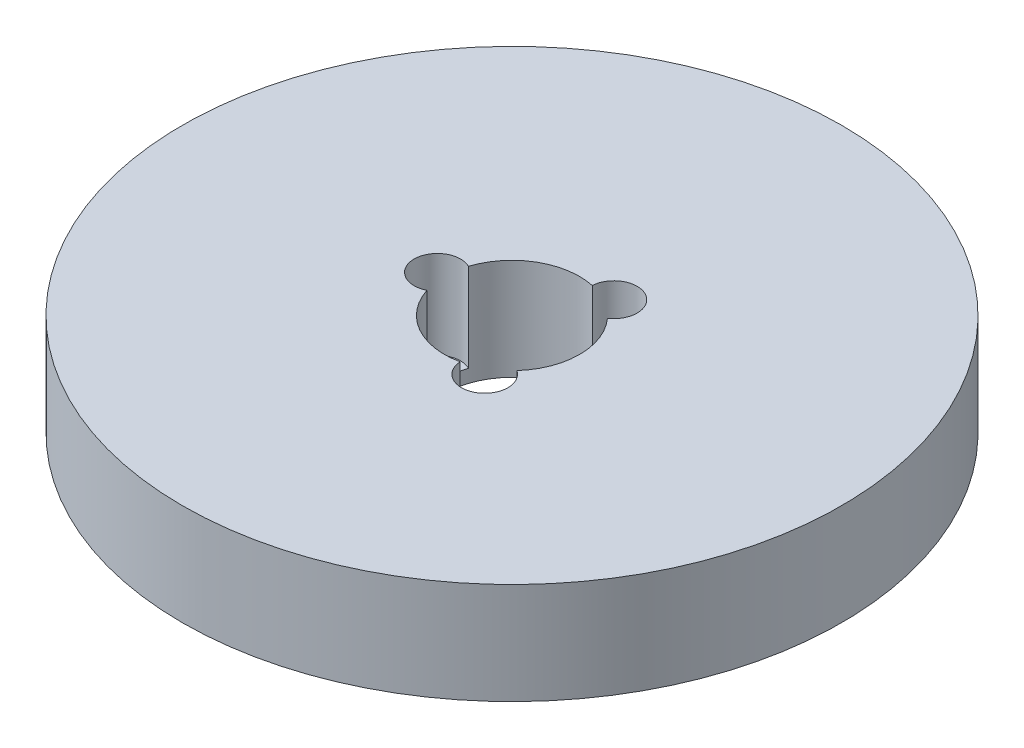
ISO-10303-21;
HEADER;
FILE_DESCRIPTION(('STEP AP214'),'2;1');
FILE_NAME('part.step','',(''),(''),'','','');
FILE_SCHEMA(('AUTOMOTIVE_DESIGN { 1 0 10303 214 1 1 1 1 }'));
ENDSEC;
DATA;
#1=APPLICATION_CONTEXT('core data for automotive mechanical design processes');
#2=APPLICATION_PROTOCOL_DEFINITION('international standard','automotive_design',2000,#1);
#3=PRODUCT_CONTEXT('',#1,'mechanical');
#4=PRODUCT('Part','Part','',(#3));
#5=PRODUCT_RELATED_PRODUCT_CATEGORY('part','',(#4));
#6=PRODUCT_DEFINITION_FORMATION('','',#4);
#7=PRODUCT_DEFINITION_CONTEXT('part definition',#1,'design');
#8=PRODUCT_DEFINITION('design','',#6,#7);
#9=PRODUCT_DEFINITION_SHAPE('','',#8);
#10=(LENGTH_UNIT() NAMED_UNIT(*) SI_UNIT(.MILLI.,.METRE.));
#11=(NAMED_UNIT(*) PLANE_ANGLE_UNIT() SI_UNIT($,.RADIAN.));
#12=(NAMED_UNIT(*) SI_UNIT($,.STERADIAN.) SOLID_ANGLE_UNIT());
#13=UNCERTAINTY_MEASURE_WITH_UNIT(LENGTH_MEASURE(1.E-05),#10,'distance_accuracy_value','');
#14=(GEOMETRIC_REPRESENTATION_CONTEXT(3) GLOBAL_UNCERTAINTY_ASSIGNED_CONTEXT((#13)) GLOBAL_UNIT_ASSIGNED_CONTEXT((#10,
#11,#12)) REPRESENTATION_CONTEXT('',''));
#15=CARTESIAN_POINT('',(0.,0.,0.));
#16=DIRECTION('',(0.,0.,1.));
#17=DIRECTION('',(1.,0.,0.));
#18=AXIS2_PLACEMENT_3D('',#15,#16,#17);
#19=CARTESIAN_POINT('',(0.,30.,0.));
#20=DIRECTION('',(0.,-1.,0.));
#21=DIRECTION('',(0.,0.,-1.));
#22=AXIS2_PLACEMENT_3D('',#19,#20,#21);
#23=CYLINDRICAL_SURFACE('',#22,97.5);
#24=CARTESIAN_POINT('',(0.,30.,0.));
#25=DIRECTION('',(0.,1.,0.));
#26=DIRECTION('',(0.,0.,1.));
#27=AXIS2_PLACEMENT_3D('',#24,#25,#26);
#28=CIRCLE('',#27,97.5);
#29=CARTESIAN_POINT('',(0.,30.,97.5));
#30=VERTEX_POINT('',#29);
#31=EDGE_CURVE('E126',#30,#30,#28,.T.);
#32=ORIENTED_EDGE('',*,*,#31,.F.);
#33=EDGE_LOOP('',(#32));
#34=FACE_BOUND('',#33,.T.);
#35=CARTESIAN_POINT('',(0.,0.,0.));
#36=DIRECTION('',(0.,1.,0.));
#37=DIRECTION('',(0.,0.,1.));
#38=AXIS2_PLACEMENT_3D('',#35,#36,#37);
#39=CIRCLE('',#38,97.5);
#40=CARTESIAN_POINT('',(0.,0.,97.5));
#41=VERTEX_POINT('',#40);
#42=EDGE_CURVE('E124',#41,#41,#39,.T.);
#43=ORIENTED_EDGE('',*,*,#42,.T.);
#44=EDGE_LOOP('',(#43));
#45=FACE_BOUND('',#44,.T.);
#46=ADVANCED_FACE('F39',(#34,#45),#23,.T.);
#47=CARTESIAN_POINT('',(0.,30.,0.));
#48=DIRECTION('',(0.,1.,0.));
#49=DIRECTION('',(0.,0.,1.));
#50=AXIS2_PLACEMENT_3D('',#47,#48,#49);
#51=PLANE('',#50);
#52=CARTESIAN_POINT('',(11.0405874034857,30.,19.122858328242));
#53=DIRECTION('',(0.,1.,0.));
#54=DIRECTION('',(0.866025403784436,0.,-0.500000000000004));
#55=AXIS2_PLACEMENT_3D('',#52,#53,#54);
#56=CIRCLE('',#55,6.86794331125664);
#57=CARTESIAN_POINT('',(4.18637624386,30.,19.556948993768));
#58=VERTEX_POINT('',#57);
#59=CARTESIAN_POINT('',(14.8436265271898,30.,13.4039826738663));
#60=VERTEX_POINT('',#59);
#61=EDGE_CURVE('E147',#58,#60,#56,.T.);
#62=ORIENTED_EDGE('',*,*,#61,.F.);
#63=CARTESIAN_POINT('',(0.,30.,0.));
#64=DIRECTION('',(0.,1.,0.));
#65=DIRECTION('',(0.,0.,1.));
#66=AXIS2_PLACEMENT_3D('',#63,#64,#65);
#67=CIRCLE('',#66,20.);
#68=CARTESIAN_POINT('',(-19.0300027710496,30.,6.15296631990167));
#69=VERTEX_POINT('',#68);
#70=EDGE_CURVE('E118',#69,#58,#67,.T.);
#71=ORIENTED_EDGE('',*,*,#70,.F.);
#72=CARTESIAN_POINT('',(-22.0811748069713,30.,0.));
#73=DIRECTION('',(0.,1.,0.));
#74=DIRECTION('',(0.,0.,1.));
#75=AXIS2_PLACEMENT_3D('',#72,#73,#74);
#76=CIRCLE('',#75,6.86794331125664);
#77=CARTESIAN_POINT('',(-19.0300027710496,30.,-6.15296631990167));
#78=VERTEX_POINT('',#77);
#79=EDGE_CURVE('E113',#78,#69,#76,.T.);
#80=ORIENTED_EDGE('',*,*,#79,.F.);
#81=CARTESIAN_POINT('',(4.18637624385972,30.,-19.5569489937681));
#82=VERTEX_POINT('',#81);
#83=EDGE_CURVE('E106',#82,#78,#67,.T.);
#84=ORIENTED_EDGE('',*,*,#83,.F.);
#85=CARTESIAN_POINT('',(11.0405874034855,30.,-19.1228583282422));
#86=DIRECTION('',(0.,1.,0.));
#87=DIRECTION('',(-0.866025403784443,0.,-0.499999999999992));
#88=AXIS2_PLACEMENT_3D('',#85,#86,#87);
#89=CIRCLE('',#88,6.86794331125664);
#90=CARTESIAN_POINT('',(14.8436265271896,30.,-13.4039826738665));
#91=VERTEX_POINT('',#90);
#92=EDGE_CURVE('E90',#91,#82,#89,.T.);
#93=ORIENTED_EDGE('',*,*,#92,.F.);
#94=EDGE_CURVE('E116',#60,#91,#67,.T.);
#95=ORIENTED_EDGE('',*,*,#94,.F.);
#96=EDGE_LOOP('',(#62,#71,#80,#84,#93,#95));
#97=FACE_BOUND('',#96,.T.);
#98=ORIENTED_EDGE('',*,*,#31,.T.);
#99=EDGE_LOOP('',(#98));
#100=FACE_BOUND('',#99,.T.);
#101=ADVANCED_FACE('F115',(#97,#100),#51,.T.);
#102=CARTESIAN_POINT('',(0.,0.,0.));
#103=DIRECTION('',(0.,1.,0.));
#104=DIRECTION('',(0.,0.,1.));
#105=AXIS2_PLACEMENT_3D('',#102,#103,#104);
#106=PLANE('',#105);
#107=CARTESIAN_POINT('',(0.,0.,0.));
#108=DIRECTION('',(0.,1.,0.));
#109=DIRECTION('',(0.,0.,1.));
#110=AXIS2_PLACEMENT_3D('',#107,#108,#109);
#111=CIRCLE('',#110,20.);
#112=CARTESIAN_POINT('',(0.,0.,20.));
#113=VERTEX_POINT('',#112);
#114=EDGE_CURVE('E120',#113,#113,#111,.T.);
#115=ORIENTED_EDGE('',*,*,#114,.T.);
#116=EDGE_LOOP('',(#115));
#117=FACE_BOUND('',#116,.T.);
#118=ORIENTED_EDGE('',*,*,#42,.F.);
#119=EDGE_LOOP('',(#118));
#120=FACE_BOUND('',#119,.T.);
#121=ADVANCED_FACE('F164',(#117,#120),#106,.F.);
#122=CARTESIAN_POINT('',(0.,30.,0.));
#123=DIRECTION('',(0.,-1.,0.));
#124=DIRECTION('',(0.,0.,-1.));
#125=AXIS2_PLACEMENT_3D('',#122,#123,#124);
#126=CYLINDRICAL_SURFACE('',#125,20.);
#127=DIRECTION('',(0.,1.,0.));
#128=VECTOR('',#127,1.);
#129=CARTESIAN_POINT('',(4.18637624386,16.9452683477106,19.556948993768));
#130=LINE('',#129,#128);
#131=CARTESIAN_POINT('',(4.18637624386,3.89053669542121,19.556948993768));
#132=VERTEX_POINT('',#131);
#133=EDGE_CURVE('E11',#132,#58,#130,.T.);
#134=ORIENTED_EDGE('',*,*,#133,.F.);
#135=CARTESIAN_POINT('',(0.,3.89053669542121,0.));
#136=DIRECTION('',(0.,1.,0.));
#137=DIRECTION('',(0.,0.,1.));
#138=AXIS2_PLACEMENT_3D('',#135,#136,#137);
#139=CIRCLE('',#138,20.);
#140=CARTESIAN_POINT('',(14.8436265271898,3.89053669542121,13.4039826738663));
#141=VERTEX_POINT('',#140);
#142=EDGE_CURVE('E144',#132,#141,#139,.T.);
#143=ORIENTED_EDGE('',*,*,#142,.T.);
#144=DIRECTION('',(0.,1.,0.));
#145=VECTOR('',#144,1.);
#146=CARTESIAN_POINT('',(14.8436265271898,16.9452683477106,13.4039826738663));
#147=LINE('',#146,#145);
#148=EDGE_CURVE('E46',#60,#141,#147,.F.);
#149=ORIENTED_EDGE('',*,*,#148,.F.);
#150=ORIENTED_EDGE('',*,*,#94,.T.);
#151=DIRECTION('',(0.,1.,0.));
#152=VECTOR('',#151,1.);
#153=CARTESIAN_POINT('',(14.8436265271896,16.9452683477106,-13.4039826738665));
#154=LINE('',#153,#152);
#155=CARTESIAN_POINT('',(14.8436265271896,3.89053669542121,-13.4039826738665));
#156=VERTEX_POINT('',#155);
#157=EDGE_CURVE('E92',#156,#91,#154,.T.);
#158=ORIENTED_EDGE('',*,*,#157,.F.);
#159=CARTESIAN_POINT('',(0.,3.89053669542121,0.));
#160=DIRECTION('',(0.,1.,0.));
#161=DIRECTION('',(0.,0.,1.));
#162=AXIS2_PLACEMENT_3D('',#159,#160,#161);
#163=CIRCLE('',#162,20.);
#164=CARTESIAN_POINT('',(4.18637624385972,3.89053669542121,-19.5569489937681));
#165=VERTEX_POINT('',#164);
#166=EDGE_CURVE('E107',#156,#165,#163,.T.);
#167=ORIENTED_EDGE('',*,*,#166,.T.);
#168=DIRECTION('',(0.,1.,0.));
#169=VECTOR('',#168,1.);
#170=CARTESIAN_POINT('',(4.18637624385972,16.9452683477106,-19.5569489937681));
#171=LINE('',#170,#169);
#172=EDGE_CURVE('E95',#82,#165,#171,.F.);
#173=ORIENTED_EDGE('',*,*,#172,.F.);
#174=ORIENTED_EDGE('',*,*,#83,.T.);
#175=DIRECTION('',(0.,1.,0.));
#176=VECTOR('',#175,1.);
#177=CARTESIAN_POINT('',(-19.0300027710496,16.9452683477106,-6.15296631990168));
#178=LINE('',#177,#176);
#179=CARTESIAN_POINT('',(-19.0300027710496,3.89053669542121,-6.15296631990167));
#180=VERTEX_POINT('',#179);
#181=EDGE_CURVE('E143',#180,#78,#178,.T.);
#182=ORIENTED_EDGE('',*,*,#181,.F.);
#183=CARTESIAN_POINT('',(0.,3.89053669542121,0.));
#184=DIRECTION('',(0.,1.,0.));
#185=DIRECTION('',(0.,0.,1.));
#186=AXIS2_PLACEMENT_3D('',#183,#184,#185);
#187=CIRCLE('',#186,20.);
#188=CARTESIAN_POINT('',(-19.0300027710496,3.89053669542121,6.15296631990167));
#189=VERTEX_POINT('',#188);
#190=EDGE_CURVE('E132',#180,#189,#187,.T.);
#191=ORIENTED_EDGE('',*,*,#190,.T.);
#192=DIRECTION('',(0.,1.,0.));
#193=VECTOR('',#192,1.);
#194=CARTESIAN_POINT('',(-19.0300027710496,16.9452683477106,6.15296631990168));
#195=LINE('',#194,#193);
#196=EDGE_CURVE('E137',#69,#189,#195,.F.);
#197=ORIENTED_EDGE('',*,*,#196,.F.);
#198=ORIENTED_EDGE('',*,*,#70,.T.);
#199=EDGE_LOOP('',(#134,#143,#149,#150,#158,#167,#173,#174,#182,#191,#197,#198));
#200=FACE_BOUND('',#199,.T.);
#201=ORIENTED_EDGE('',*,*,#114,.F.);
#202=EDGE_LOOP('',(#201));
#203=FACE_BOUND('',#202,.T.);
#204=ADVANCED_FACE('F103',(#200,#203),#126,.F.);
#205=CARTESIAN_POINT('',(-22.0811748069713,3.89053669542121,0.));
#206=DIRECTION('',(0.,1.,0.));
#207=DIRECTION('',(0.,0.,1.));
#208=AXIS2_PLACEMENT_3D('',#205,#206,#207);
#209=CYLINDRICAL_SURFACE('',#208,6.86794331125664);
#210=ORIENTED_EDGE('',*,*,#181,.T.);
#211=ORIENTED_EDGE('',*,*,#79,.T.);
#212=ORIENTED_EDGE('',*,*,#196,.T.);
#213=CARTESIAN_POINT('',(-22.0811748069713,3.89053669542121,0.));
#214=DIRECTION('',(0.,1.,0.));
#215=DIRECTION('',(0.,0.,1.));
#216=AXIS2_PLACEMENT_3D('',#213,#214,#215);
#217=CIRCLE('',#216,6.86794331125664);
#218=EDGE_CURVE('E121',#180,#189,#217,.T.);
#219=ORIENTED_EDGE('',*,*,#218,.F.);
#220=EDGE_LOOP('',(#210,#211,#212,#219));
#221=FACE_BOUND('',#220,.T.);
#222=ADVANCED_FACE('F174',(#221),#209,.F.);
#223=CARTESIAN_POINT('',(-22.0811748069713,3.89053669542121,0.));
#224=DIRECTION('',(0.,1.,0.));
#225=DIRECTION('',(0.,0.,1.));
#226=AXIS2_PLACEMENT_3D('',#223,#224,#225);
#227=PLANE('',#226);
#228=ORIENTED_EDGE('',*,*,#218,.T.);
#229=ORIENTED_EDGE('',*,*,#190,.F.);
#230=EDGE_LOOP('',(#228,#229));
#231=FACE_BOUND('',#230,.T.);
#232=ADVANCED_FACE('F177',(#231),#227,.T.);
#233=CARTESIAN_POINT('',(11.0405874034855,3.89053669542121,-19.1228583282422));
#234=DIRECTION('',(0.,1.,0.));
#235=DIRECTION('',(0.,0.,1.));
#236=AXIS2_PLACEMENT_3D('',#233,#234,#235);
#237=CYLINDRICAL_SURFACE('',#236,6.86794331125664);
#238=ORIENTED_EDGE('',*,*,#157,.T.);
#239=ORIENTED_EDGE('',*,*,#92,.T.);
#240=ORIENTED_EDGE('',*,*,#172,.T.);
#241=CARTESIAN_POINT('',(11.0405874034855,3.89053669542121,-19.1228583282422));
#242=DIRECTION('',(0.,1.,0.));
#243=DIRECTION('',(-0.866025403784443,0.,-0.499999999999992));
#244=AXIS2_PLACEMENT_3D('',#241,#242,#243);
#245=CIRCLE('',#244,6.86794331125664);
#246=EDGE_CURVE('E56',#156,#165,#245,.T.);
#247=ORIENTED_EDGE('',*,*,#246,.F.);
#248=EDGE_LOOP('',(#238,#239,#240,#247));
#249=FACE_BOUND('',#248,.T.);
#250=ADVANCED_FACE('F93',(#249),#237,.F.);
#251=CARTESIAN_POINT('',(11.0405874034855,3.89053669542121,-19.1228583282422));
#252=DIRECTION('',(0.,1.,0.));
#253=DIRECTION('',(-0.866025403784443,0.,-0.499999999999992));
#254=AXIS2_PLACEMENT_3D('',#251,#252,#253);
#255=PLANE('',#254);
#256=ORIENTED_EDGE('',*,*,#246,.T.);
#257=ORIENTED_EDGE('',*,*,#166,.F.);
#258=EDGE_LOOP('',(#256,#257));
#259=FACE_BOUND('',#258,.T.);
#260=ADVANCED_FACE('F160',(#259),#255,.T.);
#261=CARTESIAN_POINT('',(11.0405874034857,3.89053669542121,19.122858328242));
#262=DIRECTION('',(0.,1.,0.));
#263=DIRECTION('',(0.,0.,1.));
#264=AXIS2_PLACEMENT_3D('',#261,#262,#263);
#265=CYLINDRICAL_SURFACE('',#264,6.86794331125664);
#266=ORIENTED_EDGE('',*,*,#133,.T.);
#267=ORIENTED_EDGE('',*,*,#61,.T.);
#268=ORIENTED_EDGE('',*,*,#148,.T.);
#269=CARTESIAN_POINT('',(11.0405874034857,3.89053669542121,19.122858328242));
#270=DIRECTION('',(0.,1.,0.));
#271=DIRECTION('',(0.866025403784436,0.,-0.500000000000004));
#272=AXIS2_PLACEMENT_3D('',#269,#270,#271);
#273=CIRCLE('',#272,6.86794331125664);
#274=EDGE_CURVE('E55',#132,#141,#273,.T.);
#275=ORIENTED_EDGE('',*,*,#274,.F.);
#276=EDGE_LOOP('',(#266,#267,#268,#275));
#277=FACE_BOUND('',#276,.T.);
#278=ADVANCED_FACE('F149',(#277),#265,.F.);
#279=CARTESIAN_POINT('',(11.0405874034857,3.89053669542121,19.122858328242));
#280=DIRECTION('',(0.,1.,0.));
#281=DIRECTION('',(0.866025403784436,0.,-0.500000000000004));
#282=AXIS2_PLACEMENT_3D('',#279,#280,#281);
#283=PLANE('',#282);
#284=ORIENTED_EDGE('',*,*,#274,.T.);
#285=ORIENTED_EDGE('',*,*,#142,.F.);
#286=EDGE_LOOP('',(#284,#285));
#287=FACE_BOUND('',#286,.T.);
#288=ADVANCED_FACE('F151',(#287),#283,.T.);
#289=CLOSED_SHELL('',(#46,#101,#121,#204,#222,#232,#250,#260,#278,#288));
#290=MANIFOLD_SOLID_BREP('B2',#289);
#291=ADVANCED_BREP_SHAPE_REPRESENTATION('',(#18,#290),#14);
#292=SHAPE_DEFINITION_REPRESENTATION(#9,#291);
ENDSEC;
END-ISO-10303-21;
